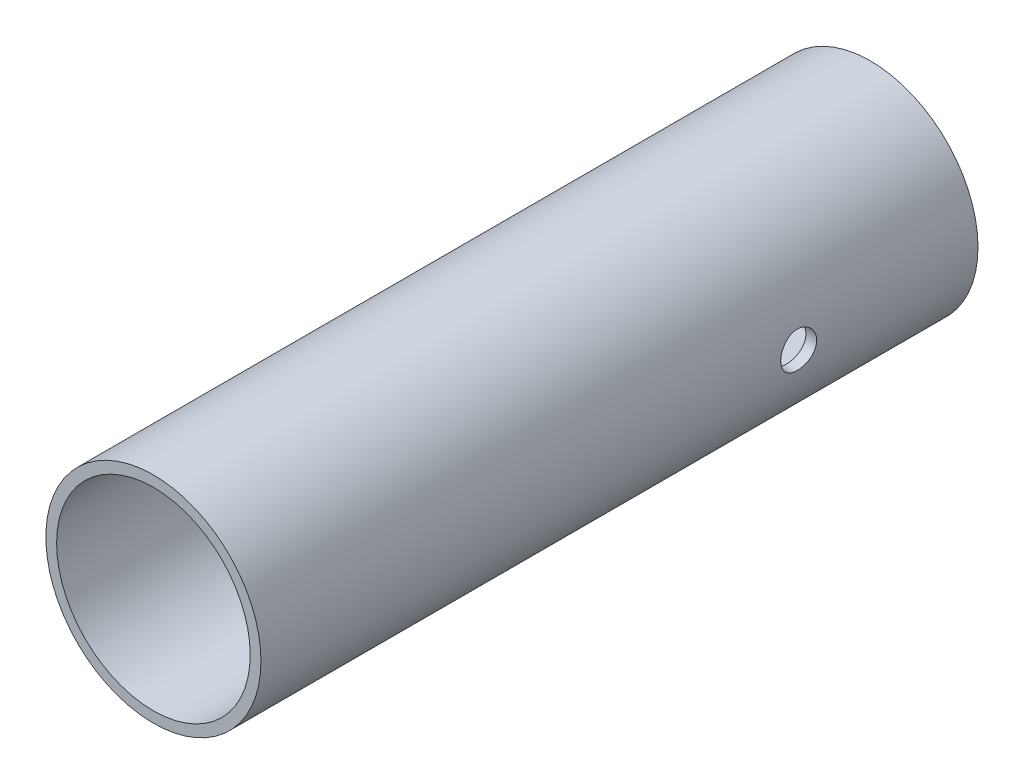
ISO-10303-21;
HEADER;
FILE_DESCRIPTION(('STEP AP214'),'2;1');
FILE_NAME('part.step','',(''),(''),'','','');
FILE_SCHEMA(('AUTOMOTIVE_DESIGN { 1 0 10303 214 1 1 1 1 }'));
ENDSEC;
DATA;
#1=APPLICATION_CONTEXT('core data for automotive mechanical design processes');
#2=APPLICATION_PROTOCOL_DEFINITION('international standard','automotive_design',2000,#1);
#3=PRODUCT_CONTEXT('',#1,'mechanical');
#4=PRODUCT('Part','Part','',(#3));
#5=PRODUCT_RELATED_PRODUCT_CATEGORY('part','',(#4));
#6=PRODUCT_DEFINITION_FORMATION('','',#4);
#7=PRODUCT_DEFINITION_CONTEXT('part definition',#1,'design');
#8=PRODUCT_DEFINITION('design','',#6,#7);
#9=PRODUCT_DEFINITION_SHAPE('','',#8);
#10=(LENGTH_UNIT() NAMED_UNIT(*) SI_UNIT(.MILLI.,.METRE.));
#11=(NAMED_UNIT(*) PLANE_ANGLE_UNIT() SI_UNIT($,.RADIAN.));
#12=(NAMED_UNIT(*) SI_UNIT($,.STERADIAN.) SOLID_ANGLE_UNIT());
#13=UNCERTAINTY_MEASURE_WITH_UNIT(LENGTH_MEASURE(1.E-05),#10,'distance_accuracy_value','');
#14=(GEOMETRIC_REPRESENTATION_CONTEXT(3) GLOBAL_UNCERTAINTY_ASSIGNED_CONTEXT((#13)) GLOBAL_UNIT_ASSIGNED_CONTEXT((#10,
#11,#12)) REPRESENTATION_CONTEXT('',''));
#15=CARTESIAN_POINT('',(0.,0.,0.));
#16=DIRECTION('',(0.,0.,1.));
#17=DIRECTION('',(1.,0.,0.));
#18=AXIS2_PLACEMENT_3D('',#15,#16,#17);
#19=CARTESIAN_POINT('',(0.,0.,200.));
#20=DIRECTION('',(0.,0.,1.));
#21=DIRECTION('',(1.,0.,0.));
#22=AXIS2_PLACEMENT_3D('',#19,#20,#21);
#23=PLANE('',#22);
#24=CARTESIAN_POINT('',(0.,0.,200.));
#25=DIRECTION('',(0.,0.,1.));
#26=DIRECTION('',(1.,0.,0.));
#27=AXIS2_PLACEMENT_3D('',#24,#25,#26);
#28=CIRCLE('',#27,30.);
#29=CARTESIAN_POINT('',(30.,0.,200.));
#30=VERTEX_POINT('',#29);
#31=EDGE_CURVE('E81',#30,#30,#28,.T.);
#32=ORIENTED_EDGE('',*,*,#31,.T.);
#33=EDGE_LOOP('',(#32));
#34=FACE_BOUND('',#33,.T.);
#35=CARTESIAN_POINT('',(0.,0.,200.));
#36=DIRECTION('',(0.,0.,1.));
#37=DIRECTION('',(1.,0.,0.));
#38=AXIS2_PLACEMENT_3D('',#35,#36,#37);
#39=CIRCLE('',#38,27.);
#40=CARTESIAN_POINT('',(27.,0.,200.));
#41=VERTEX_POINT('',#40);
#42=EDGE_CURVE('E165',#41,#41,#39,.T.);
#43=ORIENTED_EDGE('',*,*,#42,.F.);
#44=EDGE_LOOP('',(#43));
#45=FACE_BOUND('',#44,.T.);
#46=ADVANCED_FACE('F43',(#34,#45),#23,.T.);
#47=CARTESIAN_POINT('',(0.,0.,0.));
#48=DIRECTION('',(0.,0.,1.));
#49=DIRECTION('',(1.,0.,0.));
#50=AXIS2_PLACEMENT_3D('',#47,#48,#49);
#51=PLANE('',#50);
#52=CARTESIAN_POINT('',(0.,0.,0.));
#53=DIRECTION('',(0.,0.,1.));
#54=DIRECTION('',(1.,0.,0.));
#55=AXIS2_PLACEMENT_3D('',#52,#53,#54);
#56=CIRCLE('',#55,30.);
#57=CARTESIAN_POINT('',(30.,0.,0.));
#58=VERTEX_POINT('',#57);
#59=EDGE_CURVE('E168',#58,#58,#56,.T.);
#60=ORIENTED_EDGE('',*,*,#59,.F.);
#61=EDGE_LOOP('',(#60));
#62=FACE_BOUND('',#61,.T.);
#63=CARTESIAN_POINT('',(0.,0.,0.));
#64=DIRECTION('',(0.,0.,1.));
#65=DIRECTION('',(1.,0.,0.));
#66=AXIS2_PLACEMENT_3D('',#63,#64,#65);
#67=CIRCLE('',#66,27.);
#68=CARTESIAN_POINT('',(27.,0.,0.));
#69=VERTEX_POINT('',#68);
#70=EDGE_CURVE('E96',#69,#69,#67,.T.);
#71=ORIENTED_EDGE('',*,*,#70,.T.);
#72=EDGE_LOOP('',(#71));
#73=FACE_BOUND('',#72,.T.);
#74=ADVANCED_FACE('F154',(#62,#73),#51,.F.);
#75=CARTESIAN_POINT('',(0.,0.,200.));
#76=DIRECTION('',(0.,0.,-1.));
#77=DIRECTION('',(-1.,0.,0.));
#78=AXIS2_PLACEMENT_3D('',#75,#76,#77);
#79=CYLINDRICAL_SURFACE('',#78,30.);
#80=CARTESIAN_POINT('',(-30.,0.,45.));
#81=CARTESIAN_POINT('',(-30.0000009341092,0.139438730306521,44.999997851397));
#82=CARTESIAN_POINT('',(-29.9990260400444,0.278848374995364,45.0058347556485));
#83=CARTESIAN_POINT('',(-29.9951557115238,0.556708896140975,45.0291341835026));
#84=CARTESIAN_POINT('',(-29.9922598968632,0.695159577308833,45.0465990086043));
#85=CARTESIAN_POINT('',(-29.9846251699259,0.970150520344154,45.0930388128981));
#86=CARTESIAN_POINT('',(-29.979885095025,1.10668952072418,45.1220210529316));
#87=CARTESIAN_POINT('',(-29.9686930297133,1.37685247096437,45.1912860554059));
#88=CARTESIAN_POINT('',(-29.9622404112013,1.5104753317869,45.2315729643164));
#89=CARTESIAN_POINT('',(-29.9478128865368,1.77365528085701,45.323085001361));
#90=CARTESIAN_POINT('',(-29.9398398129292,1.90321704710935,45.3742969706778));
#91=CARTESIAN_POINT('',(-29.9225843720656,2.15759207174615,45.487331768374));
#92=CARTESIAN_POINT('',(-29.9133015225275,2.28240355940392,45.5491585071213));
#93=CARTESIAN_POINT('',(-29.8936901460056,2.5263122321717,45.6829311123826));
#94=CARTESIAN_POINT('',(-29.8833621400859,2.64541222152924,45.7548719433986));
#95=CARTESIAN_POINT('',(-29.8619368035706,2.87720075943644,45.9084173224229));
#96=CARTESIAN_POINT('',(-29.8508391875783,2.98988690101177,45.9900254634165));
#97=CARTESIAN_POINT('',(-29.8280901061561,3.20893550320273,46.1630259516604));
#98=CARTESIAN_POINT('',(-29.8164348485225,3.31523860199369,46.2544929703539));
#99=CARTESIAN_POINT('',(-29.792977049997,3.51981905081323,46.4460558937281));
#100=CARTESIAN_POINT('',(-29.7811744561748,3.61809341494839,46.5461549804905));
#101=CARTESIAN_POINT('',(-29.757760553176,3.80586900468399,46.7542344342712));
#102=CARTESIAN_POINT('',(-29.7461491869625,3.89537288715649,46.862212397114));
#103=CARTESIAN_POINT('',(-29.7234367117224,4.06505128766862,47.0853792425903));
#104=CARTESIAN_POINT('',(-29.7123357924676,4.14522235269034,47.2005707700571));
#105=CARTESIAN_POINT('',(-29.6909016370194,4.29606801839331,47.4380285253062));
#106=CARTESIAN_POINT('',(-29.6805732300208,4.36668480543057,47.5603319317773));
#107=CARTESIAN_POINT('',(-29.6610510502017,4.49737903615682,47.8105890866492));
#108=CARTESIAN_POINT('',(-29.6518577016161,4.55745254274492,47.9385449235652));
#109=CARTESIAN_POINT('',(-29.6348831234285,4.66655756396112,48.199119311015));
#110=CARTESIAN_POINT('',(-29.6271012976113,4.71559374278069,48.3317358645124));
#111=CARTESIAN_POINT('',(-29.6131700678879,4.80229722760727,48.600732309735));
#112=CARTESIAN_POINT('',(-29.6070212600786,4.83996038282923,48.7371135556791));
#113=CARTESIAN_POINT('',(-29.5914227981395,4.93477467758657,49.1478014758557));
#114=CARTESIAN_POINT('',(-29.5846386003063,4.97488357358492,49.4263688653698));
#115=CARTESIAN_POINT('',(-29.5790755483693,5.00784793424047,49.9862031583844));
#116=CARTESIAN_POINT('',(-29.5802961277241,5.00070674304214,50.2674698694324));
#117=CARTESIAN_POINT('',(-29.590529429811,4.93978637434361,50.8218444785728));
#118=CARTESIAN_POINT('',(-29.5994616948564,4.88648873937524,51.0950065937395));
#119=CARTESIAN_POINT('',(-29.6239896757343,4.73550730524631,51.6284456491125));
#120=CARTESIAN_POINT('',(-29.6395856201047,4.63782198375657,51.8887221470515));
#121=CARTESIAN_POINT('',(-29.6757696483376,4.40035421574882,52.3904568337189));
#122=CARTESIAN_POINT('',(-29.6963813586744,4.2603717536546,52.6318185941789));
#123=CARTESIAN_POINT('',(-29.7402583517709,3.94242410922567,53.0878090190779));
#124=CARTESIAN_POINT('',(-29.7635238486315,3.76445586128013,53.3024355236554));
#125=CARTESIAN_POINT('',(-29.8104405621052,3.37296440409905,53.7016521121411));
#126=CARTESIAN_POINT('',(-29.8340929858412,3.15902792232791,53.8858370211496));
#127=CARTESIAN_POINT('',(-29.8788520267263,2.70307050338167,54.2157555412613));
#128=CARTESIAN_POINT('',(-29.8999586274719,2.46104938526711,54.361488904615));
#129=CARTESIAN_POINT('',(-29.9372778581815,1.95541183087794,54.6104044500204));
#130=CARTESIAN_POINT('',(-29.9534863682324,1.6917774507324,54.7135508376042));
#131=CARTESIAN_POINT('',(-29.9791500601698,1.15059669160235,54.8739884315502));
#132=CARTESIAN_POINT('',(-29.988605806999,0.873051478491177,54.9312834739288));
#133=CARTESIAN_POINT('',(-29.999622596864,0.315419802472569,54.9978427169407));
#134=CARTESIAN_POINT('',(-30.0012750602153,0.0354014741699832,55.0076631447181));
#135=CARTESIAN_POINT('',(-29.9967494884638,-0.522279545647728,54.9804773100369));
#136=CARTESIAN_POINT('',(-29.9905717546544,-0.799942327386594,54.9434728493235));
#137=CARTESIAN_POINT('',(-29.971136538593,-1.34331235148859,54.8241503057114));
#138=CARTESIAN_POINT('',(-29.9579220953842,-1.60908173821581,54.7421075996025));
#139=CARTESIAN_POINT('',(-29.9258892897492,-2.12309376827573,54.5353309472172));
#140=CARTESIAN_POINT('',(-29.9070706126377,-2.3713354264338,54.4105946035757));
#141=CARTESIAN_POINT('',(-29.8656903236297,-2.84566138437112,54.1206978123005));
#142=CARTESIAN_POINT('',(-29.8430971086773,-3.07153052223236,53.9551899188577));
#143=CARTESIAN_POINT('',(-29.7967693569018,-3.4924871506458,53.5889251380208));
#144=CARTESIAN_POINT('',(-29.7730347372687,-3.68757240338596,53.3881656902801));
#145=CARTESIAN_POINT('',(-29.7268034705286,-4.04348563611054,52.9546057759653));
#146=CARTESIAN_POINT('',(-29.7043221945332,-4.20393781021311,52.7214949394481));
#147=CARTESIAN_POINT('',(-29.6634307237625,-4.48340433261339,52.2312907913497));
#148=CARTESIAN_POINT('',(-29.6450203999454,-4.60241999444131,51.9741982403122));
#149=CARTESIAN_POINT('',(-29.6144685973239,-4.79507773356376,51.4444326927225));
#150=CARTESIAN_POINT('',(-29.602301310812,-4.8689068530604,51.1718290988087));
#151=CARTESIAN_POINT('',(-29.5855561119601,-4.96966691993876,50.6177144566247));
#152=CARTESIAN_POINT('',(-29.580977539818,-4.99660194454597,50.3362041849162));
#153=CARTESIAN_POINT('',(-29.5801885462874,-5.00123212445088,49.9155902165825));
#154=CARTESIAN_POINT('',(-29.5809172344068,-4.99693975789016,49.7764630779757));
#155=CARTESIAN_POINT('',(-29.5843160283654,-4.9767843680174,49.4990874155143));
#156=CARTESIAN_POINT('',(-29.5869854047428,-4.96092569221813,49.3608385812147));
#157=CARTESIAN_POINT('',(-29.5941926651669,-4.9177464052992,49.0861522107232));
#158=CARTESIAN_POINT('',(-29.5987312164982,-4.89042170080801,48.9497153393651));
#159=CARTESIAN_POINT('',(-29.6095423170401,-4.82453301754956,48.6797035451246));
#160=CARTESIAN_POINT('',(-29.615814242021,-4.78597308458849,48.5461276105738));
#161=CARTESIAN_POINT('',(-29.6299071307843,-4.69793428640029,48.2828313948784));
#162=CARTESIAN_POINT('',(-29.6377268263817,-4.64846435664849,48.153108056479));
#163=CARTESIAN_POINT('',(-29.6546930297384,-4.5389698667498,47.8983412735622));
#164=CARTESIAN_POINT('',(-29.6638390620139,-4.47894908739057,47.773296172049));
#165=CARTESIAN_POINT('',(-29.6832065043881,-4.34874498523011,47.5286385492005));
#166=CARTESIAN_POINT('',(-29.6934283356131,-4.27855767862002,47.4090281817446));
#167=CARTESIAN_POINT('',(-29.7146554589665,-4.12855715704192,47.1761384743683));
#168=CARTESIAN_POINT('',(-29.7256604751555,-4.04874732556527,47.0628569294789));
#169=CARTESIAN_POINT('',(-29.7482907408856,-3.87899685367997,46.8419913012979));
#170=CARTESIAN_POINT('',(-29.7599219326499,-3.78894418512201,46.7344939098959));
#171=CARTESIAN_POINT('',(-29.783347263822,-3.60017574898996,46.527486603521));
#172=CARTESIAN_POINT('',(-29.7951413435574,-3.50146308651916,46.4279738499038));
#173=CARTESIAN_POINT('',(-29.8185735949796,-3.29596225179814,46.2375180700226));
#174=CARTESIAN_POINT('',(-29.8302116694714,-3.18916929766622,46.1465801909689));
#175=CARTESIAN_POINT('',(-29.8529952569281,-2.96833108680549,45.9740042838951));
#176=CARTESIAN_POINT('',(-29.8641409501131,-2.8542885214692,45.8923628356654));
#177=CARTESIAN_POINT('',(-29.8857116363867,-2.61883824287209,45.7383549695894));
#178=CARTESIAN_POINT('',(-29.896130775176,-2.49738284629916,45.6660606010677));
#179=CARTESIAN_POINT('',(-29.9158586577262,-2.24876507402074,45.5320032528141));
#180=CARTESIAN_POINT('',(-29.925167809621,-2.1216048197654,45.4702363985834));
#181=CARTESIAN_POINT('',(-29.9424090895346,-1.86251821435404,45.3576992937319));
#182=CARTESIAN_POINT('',(-29.950342172599,-1.73059524615479,45.3069214102253));
#183=CARTESIAN_POINT('',(-29.9646113279921,-1.46288984328884,45.2167051811047));
#184=CARTESIAN_POINT('',(-29.9709477429356,-1.32710824358209,45.1772644025061));
#185=CARTESIAN_POINT('',(-29.9841083147641,-0.995492141379855,45.0960216988299));
#186=CARTESIAN_POINT('',(-29.9900398634941,-0.798161887183508,45.0600563429683));
#187=CARTESIAN_POINT('',(-29.9979850016837,-0.400534394814455,45.0120472422013));
#188=CARTESIAN_POINT('',(-29.9999986585978,-0.200237207783447,45.0000030854431));
#189=CARTESIAN_POINT('',(-30.,0.,45.));
#190=B_SPLINE_CURVE_WITH_KNOTS('',3,(#80,#81,#82,#83,#84,#85,#86,#87,#88,#89,#90,#91,#92,#93,
#94,#95,#96,#97,#98,#99,#100,#101,#102,#103,#104,#105,#106,#107,#108,#109,#110,#111,#112,#113,
#114,#115,#116,#117,#118,#119,#120,#121,#122,#123,#124,#125,#126,#127,#128,#129,#130,#131,#132,
#133,#134,#135,#136,#137,#138,#139,#140,#141,#142,#143,#144,#145,#146,#147,#148,#149,#150,#151,
#152,#153,#154,#155,#156,#157,#158,#159,#160,#161,#162,#163,#164,#165,#166,#167,#168,#169,#170,
#171,#172,#173,#174,#175,#176,#177,#178,#179,#180,#181,#182,#183,#184,#185,#186,#187,#188,#189),
.UNSPECIFIED.,.T.,.F.,(4,2,2,2,2,2,2,2,2,2,2,2,2,2,2,2,2,2,2,2,2,2,2,2,2,2,2,2,2,2,2,2,2,2,2,2,
2,2,2,2,2,2,2,2,2,2,2,2,2,2,2,2,2,2,4),(0.,0.418140677636318,0.836364141924729,1.25485168316257,
1.67349292366114,2.09163274536573,2.5099269371459,2.92801360569261,3.34625615217359,
3.76792473637698,4.18974943231195,4.61144594582071,5.03329798883919,5.45759827861685,
5.88205667621391,6.30633536657098,6.73076871826471,7.57090272280956,8.41097726715882,
9.24239161594926,10.0738344812487,10.9092723133922,11.7447775943525,12.5906365789676,
13.436501013458,14.2830749590591,15.129578071164,15.966138850569,16.8026674414583,
17.6341373208694,18.4656538972624,19.3045176932815,20.1434424418267,20.9910576208934,
21.8386459282599,22.6827016275765,23.5266839364734,23.943862966713,24.3608852695981,
24.7780565762499,25.1950778447661,25.6117588257788,26.0282907967258,26.4449864317717,
26.861535972448,27.2831832626946,27.7046799813851,28.1264281209231,28.5480205921466,
28.9726903230861,29.3972034214197,29.8214207018256,30.245546875553,30.846016796232,
31.446476378491),.UNSPECIFIED.);
#191=CARTESIAN_POINT('',(-30.,0.,45.));
#192=VERTEX_POINT('',#191);
#193=EDGE_CURVE('E91',#192,#192,#190,.T.);
#194=ORIENTED_EDGE('',*,*,#193,.T.);
#195=EDGE_LOOP('',(#194));
#196=FACE_BOUND('',#195,.T.);
#197=CARTESIAN_POINT('',(29.975,-1.2244896896258,45.1522556791844));
#198=CARTESIAN_POINT('',(29.9694375962078,-1.36085341032094,45.1866839138636));
#199=CARTESIAN_POINT('',(29.962988413425,-1.49571661718018,45.2268845373549));
#200=CARTESIAN_POINT('',(29.9485345498424,-1.76149327115684,45.3184560952568));
#201=CARTESIAN_POINT('',(29.9405300516752,-1.89240717993679,45.3698257182337));
#202=CARTESIAN_POINT('',(29.9231910078997,-2.14923862859925,45.4833114777652));
#203=CARTESIAN_POINT('',(29.9138578196197,-2.27516110170596,45.5454166610706));
#204=CARTESIAN_POINT('',(29.8941197603895,-2.52127692984023,45.6799504571785));
#205=CARTESIAN_POINT('',(29.8837148819627,-2.64147024489,45.7523791420038));
#206=CARTESIAN_POINT('',(29.8621243999678,-2.87529406921399,45.9070386539423));
#207=CARTESIAN_POINT('',(29.85093882507,-2.9889248192122,45.989269121173));
#208=CARTESIAN_POINT('',(29.8280949365349,-3.2088916741323,46.1629878454813));
#209=CARTESIAN_POINT('',(29.8164364497285,-3.31522506786423,46.2544795124649));
#210=CARTESIAN_POINT('',(29.7929812633112,-3.51978187519843,46.446021868347));
#211=CARTESIAN_POINT('',(29.7811846224197,-3.61800860104324,46.5460690272585));
#212=CARTESIAN_POINT('',(29.7577744125255,-3.80576113133981,46.7541068733148));
#213=CARTESIAN_POINT('',(29.7461609128781,-3.89528370283087,46.8621004860234));
#214=CARTESIAN_POINT('',(29.7233817553101,-4.06546344309396,47.0859159092934));
#215=CARTESIAN_POINT('',(29.7122191248981,-4.14606551253463,47.2017799335435));
#216=CARTESIAN_POINT('',(29.6907307304263,-4.29724832092564,47.4400066037102));
#217=CARTESIAN_POINT('',(29.6804052790844,-4.36782532246918,47.5623716500103));
#218=CARTESIAN_POINT('',(29.6608976837227,-4.49838935395414,47.8126702622326));
#219=CARTESIAN_POINT('',(29.6517152126806,-4.55837941502449,47.9406022211824));
#220=CARTESIAN_POINT('',(29.6347553799039,-4.66736742082048,48.2012122825937));
#221=CARTESIAN_POINT('',(29.6269785323911,-4.71636134438592,48.3338921007946));
#222=CARTESIAN_POINT('',(29.6131072783644,-4.80268446849643,48.6021614906415));
#223=CARTESIAN_POINT('',(29.6070026533979,-4.84008470839615,48.7377276734071));
#224=CARTESIAN_POINT('',(29.5965894740168,-4.90335817462528,49.0116455721217));
#225=CARTESIAN_POINT('',(29.5922815841599,-4.92922713612816,49.14999829893));
#226=CARTESIAN_POINT('',(29.5855947209451,-4.96920486173593,49.428367433794));
#227=CARTESIAN_POINT('',(29.5832147634147,-4.98331962623713,49.5683829559371));
#228=CARTESIAN_POINT('',(29.5804500911259,-4.99970401302449,49.8491747526105));
#229=CARTESIAN_POINT('',(29.5800661075169,-5.00196929470382,49.9899512870087));
#230=CARTESIAN_POINT('',(29.5813003304671,-4.99466619127279,50.2694370273893));
#231=CARTESIAN_POINT('',(29.5828935969935,-4.9852452114153,50.4081500985457));
#232=CARTESIAN_POINT('',(29.5879896874776,-4.9549042501804,50.6842915272929));
#233=CARTESIAN_POINT('',(29.5914932093136,-4.93398006628514,50.8217193966828));
#234=CARTESIAN_POINT('',(29.6047355815401,-4.8541464378944,51.2305094827098));
#235=CARTESIAN_POINT('',(29.6172077854026,-4.77816818769822,51.4986626825074));
#236=CARTESIAN_POINT('',(29.6480408332987,-4.58293783602689,52.0183949264651));
#237=CARTESIAN_POINT('',(29.6664058102725,-4.46365535506844,52.2699621882313));
#238=CARTESIAN_POINT('',(29.7069612087054,-4.18523410136701,52.7496703848356));
#239=CARTESIAN_POINT('',(29.7291517241531,-4.02609434933773,52.9778107438845));
#240=CARTESIAN_POINT('',(29.7752030870657,-3.67012298626588,53.407191300291));
#241=CARTESIAN_POINT('',(29.7990813512309,-3.47284494695979,53.6080594578701));
#242=CARTESIAN_POINT('',(29.8455906744257,-3.04736202662762,53.9739522161299));
#243=CARTESIAN_POINT('',(29.8682219010042,-2.81916131461418,54.1389816408168));
#244=CARTESIAN_POINT('',(29.907095467426,-2.36855341807816,54.4102221097549));
#245=CARTESIAN_POINT('',(29.9237839570908,-2.14907344631766,54.5212355805833));
#246=CARTESIAN_POINT('',(29.9455999340874,-1.80941372085991,54.6627361561107));
#247=CARTESIAN_POINT('',(29.9523371983646,-1.69442106692063,54.7057413887027));
#248=CARTESIAN_POINT('',(29.9646062428044,-1.46150806406141,54.7832054084369));
#249=CARTESIAN_POINT('',(29.9701378177027,-1.34358722042837,54.8176627404677));
#250=CARTESIAN_POINT('',(29.975,-1.22448968962579,54.8477443208156));
#251=B_SPLINE_CURVE_WITH_KNOTS('',3,(#197,#198,#199,#200,#201,#202,#203,#204,#205,#206,#207,
#208,#209,#210,#211,#212,#213,#214,#215,#216,#217,#218,#219,#220,#221,#222,#223,#224,#225,#226,
#227,#228,#229,#230,#231,#232,#233,#234,#235,#236,#237,#238,#239,#240,#241,#242,#243,#244,#245,
#246,#247,#248,#249,#250),.UNSPECIFIED.,.F.,.F.,(4,2,2,2,2,2,2,2,2,2,2,2,2,2,2,2,2,2,2,2,2,2,2,
2,2,2,4),(0.,0.42212072957739,0.844191921625176,1.26583499865214,1.6874810174546,
2.10911155986046,2.53089791215558,2.95251106784483,3.37428022869377,3.79852410042349,
4.2229257200831,4.6472056322066,5.07164044669495,5.4934206748605,5.91535676866165,
6.33707733617169,6.7589523741414,7.17555976406753,7.59231945630744,8.42499578416147,
9.25825739695962,10.0915394848611,10.9352411979807,11.7788292757096,12.515567632751,
12.8841378882871,13.25277084265),.UNSPECIFIED.);
#252=CARTESIAN_POINT('',(29.975,-1.22448968962579,45.1522556791844));
#253=VERTEX_POINT('',#252);
#254=CARTESIAN_POINT('',(29.975,-1.2244896896258,54.8477443208156));
#255=VERTEX_POINT('',#254);
#256=EDGE_CURVE('E85',#253,#255,#251,.T.);
#257=ORIENTED_EDGE('',*,*,#256,.T.);
#258=CARTESIAN_POINT('',(29.9723,-1.28888816815102,54.828226856725));
#259=CARTESIAN_POINT('',(29.9774792161518,-1.16862735748478,54.8657051438384));
#260=CARTESIAN_POINT('',(29.9819893969917,-1.04671081938261,54.8979833554159));
#261=CARTESIAN_POINT('',(29.9895698792429,-0.8004702567467,54.9518680335267));
#262=CARTESIAN_POINT('',(29.9926398563378,-0.676145696512674,54.9734720964298));
#263=CARTESIAN_POINT('',(29.9971761623874,-0.429287873625843,55.0053020155114));
#264=CARTESIAN_POINT('',(29.9986819788812,-0.306791654512645,55.0158081632507));
#265=CARTESIAN_POINT('',(30.0001882899959,-0.0614018397805707,55.0263144821186));
#266=CARTESIAN_POINT('',(30.0001892394808,0.061491624535011,55.0263178278434));
#267=CARTESIAN_POINT('',(29.9982940489119,0.36961910153008,55.0131073537412));
#268=CARTESIAN_POINT('',(29.9954282590263,0.554619431812374,54.9931387642707));
#269=CARTESIAN_POINT('',(29.9886430596383,0.830693982127712,54.9452556232475));
#270=CARTESIAN_POINT('',(29.985926565339,0.923405855127198,54.9260188309716));
#271=CARTESIAN_POINT('',(29.979697546751,1.10733904490896,54.8815701444404));
#272=CARTESIAN_POINT('',(29.9761851887493,1.1985606688003,54.8563594983074));
#273=CARTESIAN_POINT('',(29.9723,1.28888816815103,54.828226856725));
#274=B_SPLINE_CURVE_WITH_KNOTS('',3,(#258,#259,#260,#261,#262,#263,#264,#265,#266,#267,#268,
#269,#270,#271,#272,#273),.UNSPECIFIED.,.F.,.F.,(4,2,2,2,2,2,2,4),(0.,0.378105811686945,
0.756296727376384,1.12468924586133,1.49297041333425,2.04944115162784,2.33344798419236,
2.6173955312067),.UNSPECIFIED.);
#275=CARTESIAN_POINT('',(29.975,1.2244896896258,54.8477443208156));
#276=VERTEX_POINT('',#275);
#277=EDGE_CURVE('E11',#255,#276,#274,.T.);
#278=ORIENTED_EDGE('',*,*,#277,.T.);
#279=CARTESIAN_POINT('',(29.975,1.2244896896258,54.8477443208156));
#280=CARTESIAN_POINT('',(29.9694375962078,1.36085341032094,54.8133160861364));
#281=CARTESIAN_POINT('',(29.962988413425,1.49571661718018,54.7731154626451));
#282=CARTESIAN_POINT('',(29.9485345498424,1.76149327115684,54.6815439047432));
#283=CARTESIAN_POINT('',(29.9405300516752,1.89240717993679,54.6301742817663));
#284=CARTESIAN_POINT('',(29.9231910078997,2.14923862859926,54.5166885222348));
#285=CARTESIAN_POINT('',(29.9138578196197,2.27516110170596,54.4545833389294));
#286=CARTESIAN_POINT('',(29.8941197603895,2.52127692984024,54.3200495428215));
#287=CARTESIAN_POINT('',(29.8837148819627,2.64147024489,54.2476208579962));
#288=CARTESIAN_POINT('',(29.8621243999678,2.875294069214,54.0929613460577));
#289=CARTESIAN_POINT('',(29.85093882507,2.98892481921221,54.010730878827));
#290=CARTESIAN_POINT('',(29.8280949365349,3.20889167413231,53.8370121545187));
#291=CARTESIAN_POINT('',(29.8164364497285,3.31522506786423,53.7455204875351));
#292=CARTESIAN_POINT('',(29.7929812633112,3.51978187519844,53.553978131653));
#293=CARTESIAN_POINT('',(29.7811846224197,3.61800860104324,53.4539309727415));
#294=CARTESIAN_POINT('',(29.7577744125255,3.80576113133982,53.2458931266852));
#295=CARTESIAN_POINT('',(29.7461609128781,3.89528370283087,53.1378995139766));
#296=CARTESIAN_POINT('',(29.7233817553101,4.06546344309396,52.9140840907066));
#297=CARTESIAN_POINT('',(29.7122191248981,4.14606551253463,52.7982200664565));
#298=CARTESIAN_POINT('',(29.6907307304263,4.29724832092564,52.5599933962898));
#299=CARTESIAN_POINT('',(29.6804052790844,4.36782532246919,52.4376283499897));
#300=CARTESIAN_POINT('',(29.6608976837227,4.49838935395415,52.1873297377674));
#301=CARTESIAN_POINT('',(29.6517152126806,4.55837941502449,52.0593977788176));
#302=CARTESIAN_POINT('',(29.6347553799039,4.66736742082048,51.7987877174063));
#303=CARTESIAN_POINT('',(29.6269785323911,4.71636134438592,51.6661078992054));
#304=CARTESIAN_POINT('',(29.6131072783644,4.80268446849643,51.3978385093585));
#305=CARTESIAN_POINT('',(29.6070026533979,4.84008470839615,51.2622723265929));
#306=CARTESIAN_POINT('',(29.5965894740168,4.90335817462529,50.9883544278783));
#307=CARTESIAN_POINT('',(29.5922815841599,4.92922713612817,50.85000170107));
#308=CARTESIAN_POINT('',(29.5855947209451,4.96920486173594,50.571632566206));
#309=CARTESIAN_POINT('',(29.5832147634147,4.98331962623713,50.431617044063));
#310=CARTESIAN_POINT('',(29.5804500911259,4.9997040130245,50.1508252473896));
#311=CARTESIAN_POINT('',(29.5800661075169,5.00196929470383,50.0100487129913));
#312=CARTESIAN_POINT('',(29.5813003304671,4.9946661912728,49.7305629726107));
#313=CARTESIAN_POINT('',(29.5828935969935,4.98524521141531,49.5918499014543));
#314=CARTESIAN_POINT('',(29.5879896874776,4.95490425018041,49.3157084727071));
#315=CARTESIAN_POINT('',(29.5914932093136,4.93398006628515,49.1782806033172));
#316=CARTESIAN_POINT('',(29.6047355815401,4.85414643789441,48.7694905172902));
#317=CARTESIAN_POINT('',(29.6172077854026,4.77816818769823,48.5013373174926));
#318=CARTESIAN_POINT('',(29.6480408332987,4.58293783602689,47.9816050735349));
#319=CARTESIAN_POINT('',(29.6664058102725,4.46365535506844,47.7300378117687));
#320=CARTESIAN_POINT('',(29.7069612087054,4.18523410136701,47.2503296151644));
#321=CARTESIAN_POINT('',(29.7291517241531,4.02609434933773,47.0221892561155));
#322=CARTESIAN_POINT('',(29.7752030870657,3.67012298626588,46.592808699709));
#323=CARTESIAN_POINT('',(29.7990813512309,3.4728449469598,46.39194054213));
#324=CARTESIAN_POINT('',(29.8455906744257,3.04736202662762,46.0260477838701));
#325=CARTESIAN_POINT('',(29.8682219010042,2.81916131461419,45.8610183591832));
#326=CARTESIAN_POINT('',(29.907095467426,2.36855341807817,45.5897778902451));
#327=CARTESIAN_POINT('',(29.9237839570908,2.14907344631768,45.4787644194167));
#328=CARTESIAN_POINT('',(29.9455999340874,1.80941372085992,45.3372638438893));
#329=CARTESIAN_POINT('',(29.9523371983646,1.69442106692064,45.2942586112973));
#330=CARTESIAN_POINT('',(29.9646062428044,1.46150806406142,45.2167945915631));
#331=CARTESIAN_POINT('',(29.9701378177027,1.34358722042837,45.1823372595323));
#332=CARTESIAN_POINT('',(29.975,1.2244896896258,45.1522556791844));
#333=B_SPLINE_CURVE_WITH_KNOTS('',3,(#279,#280,#281,#282,#283,#284,#285,#286,#287,#288,#289,
#290,#291,#292,#293,#294,#295,#296,#297,#298,#299,#300,#301,#302,#303,#304,#305,#306,#307,#308,
#309,#310,#311,#312,#313,#314,#315,#316,#317,#318,#319,#320,#321,#322,#323,#324,#325,#326,#327,
#328,#329,#330,#331,#332),.UNSPECIFIED.,.F.,.F.,(4,2,2,2,2,2,2,2,2,2,2,2,2,2,2,2,2,2,2,2,2,2,2,
2,2,2,4),(0.,0.422120729577389,0.844191921625179,1.26583499865215,1.6874810174546,
2.10911155986047,2.53089791215558,2.95251106784483,3.37428022869377,3.7985241004235,
4.22292572008309,4.6472056322066,5.07164044669495,5.49342067486051,5.91535676866165,
6.33707733617168,6.75895237414139,7.17555976406753,7.59231945630745,8.42499578416148,
9.25825739695963,10.0915394848611,10.9352411979807,11.7788292757096,12.515567632751,
12.8841378882871,13.25277084265),.UNSPECIFIED.);
#334=CARTESIAN_POINT('',(29.975,1.2244896896258,45.1522556791844));
#335=VERTEX_POINT('',#334);
#336=EDGE_CURVE('E84',#276,#335,#333,.T.);
#337=ORIENTED_EDGE('',*,*,#336,.T.);
#338=CARTESIAN_POINT('',(29.9723,1.28888816815103,45.171773143275));
#339=CARTESIAN_POINT('',(29.9774792161518,1.16862735748479,45.1342948561616));
#340=CARTESIAN_POINT('',(29.9819893969917,1.04671081938262,45.1020166445841));
#341=CARTESIAN_POINT('',(29.9895698792429,0.800470256746709,45.0481319664733));
#342=CARTESIAN_POINT('',(29.9926398563378,0.676145696512683,45.0265279035702));
#343=CARTESIAN_POINT('',(29.9971761623874,0.429287873625853,44.9946979844886));
#344=CARTESIAN_POINT('',(29.9986819788812,0.306791654512655,44.9841918367493));
#345=CARTESIAN_POINT('',(30.0001882899959,0.0614018397805801,44.9736855178814));
#346=CARTESIAN_POINT('',(30.0001892394808,-0.0614916245350017,44.9736821721566));
#347=CARTESIAN_POINT('',(29.9982940489119,-0.369619101530071,44.9868926462588));
#348=CARTESIAN_POINT('',(29.9954282590263,-0.554619431812366,45.0068612357293));
#349=CARTESIAN_POINT('',(29.9886430596383,-0.830693982127703,45.0547443767525));
#350=CARTESIAN_POINT('',(29.985926565339,-0.92340585512719,45.0739811690284));
#351=CARTESIAN_POINT('',(29.979697546751,-1.10733904490895,45.1184298555596));
#352=CARTESIAN_POINT('',(29.9761851887493,-1.19856066880029,45.1436405016926));
#353=CARTESIAN_POINT('',(29.9723,-1.28888816815102,45.171773143275));
#354=B_SPLINE_CURVE_WITH_KNOTS('',3,(#338,#339,#340,#341,#342,#343,#344,#345,#346,#347,#348,
#349,#350,#351,#352,#353),.UNSPECIFIED.,.F.,.F.,(4,2,2,2,2,2,2,4),(0.,0.378105811686945,
0.756296727376385,1.12468924586133,1.49297041333425,2.04944115162784,2.33344798419236,
2.6173955312067),.UNSPECIFIED.);
#355=EDGE_CURVE('E58',#335,#253,#354,.T.);
#356=ORIENTED_EDGE('',*,*,#355,.T.);
#357=EDGE_LOOP('',(#257,#278,#337,#356));
#358=FACE_BOUND('',#357,.T.);
#359=ORIENTED_EDGE('',*,*,#31,.F.);
#360=EDGE_LOOP('',(#359));
#361=FACE_BOUND('',#360,.T.);
#362=ORIENTED_EDGE('',*,*,#59,.T.);
#363=EDGE_LOOP('',(#362));
#364=FACE_BOUND('',#363,.T.);
#365=ADVANCED_FACE('F45',(#196,#358,#361,#364),#79,.T.);
#366=CARTESIAN_POINT('',(0.,0.,200.));
#367=DIRECTION('',(0.,0.,-1.));
#368=DIRECTION('',(-1.,0.,0.));
#369=AXIS2_PLACEMENT_3D('',#366,#367,#368);
#370=CYLINDRICAL_SURFACE('',#369,27.);
#371=CARTESIAN_POINT('',(-27.,0.,55.));
#372=CARTESIAN_POINT('',(-27.0000011760326,-0.139198402917015,55.0000024699379));
#373=CARTESIAN_POINT('',(-26.998921618947,-0.278364741431728,54.9941854977806));
#374=CARTESIAN_POINT('',(-26.9946360919045,-0.555737001810643,54.9709675004771));
#375=CARTESIAN_POINT('',(-26.9914297339944,-0.693942743802335,54.9535643618775));
#376=CARTESIAN_POINT('',(-26.9829762754062,-0.968433858074517,54.9072928039426));
#377=CARTESIAN_POINT('',(-26.9777280116532,-1.10471808993002,54.8784178500327));
#378=CARTESIAN_POINT('',(-26.9653355643094,-1.37437288093465,54.8094151357267));
#379=CARTESIAN_POINT('',(-26.9581906844812,-1.50774235059126,54.7692832426621));
#380=CARTESIAN_POINT('',(-26.9422147776107,-1.77041125219824,54.6781348695009));
#381=CARTESIAN_POINT('',(-26.9333859132381,-1.89971565930157,54.6271323403382));
#382=CARTESIAN_POINT('',(-26.9142762389755,-2.15358925706926,54.5145698675467));
#383=CARTESIAN_POINT('',(-26.9039948940782,-2.278156681357,54.4530060319632));
#384=CARTESIAN_POINT('',(-26.882270136108,-2.5216031153913,54.3198102716848));
#385=CARTESIAN_POINT('',(-26.8708272708381,-2.64048476813229,54.2481830870598));
#386=CARTESIAN_POINT('',(-26.8470836448711,-2.87186925318301,54.0953145695971));
#387=CARTESIAN_POINT('',(-26.8347825652134,-2.98436968540745,54.0140696543718));
#388=CARTESIAN_POINT('',(-26.8095346280705,-3.20329822260329,53.8416777842821));
#389=CARTESIAN_POINT('',(-26.7965824992416,-3.30965344061783,53.7504390271541));
#390=CARTESIAN_POINT('',(-26.7705046387995,-3.51436118055656,53.5593369237819));
#391=CARTESIAN_POINT('',(-26.7573788446592,-3.61271072361219,53.4594703954246));
#392=CARTESIAN_POINT('',(-26.7313288283512,-3.80066580254503,53.2518520140035));
#393=CARTESIAN_POINT('',(-26.7184045476821,-3.89027391740952,53.1441025031771));
#394=CARTESIAN_POINT('',(-26.6931118949527,-4.06019218856548,52.9213808823963));
#395=CARTESIAN_POINT('',(-26.6807437296764,-4.14049890346407,52.806406123313));
#396=CARTESIAN_POINT('',(-26.6568312938301,-4.29176597473288,52.5691785019454));
#397=CARTESIAN_POINT('',(-26.6452937555931,-4.36265320753198,52.4468783093466));
#398=CARTESIAN_POINT('',(-26.6234750384761,-4.49388512111764,52.1965825592915));
#399=CARTESIAN_POINT('',(-26.6131943304199,-4.55422585467413,52.0685848918374));
#400=CARTESIAN_POINT('',(-26.5942017209862,-4.66385450609766,51.8078818598037));
#401=CARTESIAN_POINT('',(-26.5854891366774,-4.71314723777012,51.6751785748495));
#402=CARTESIAN_POINT('',(-26.5698816277064,-4.80034627845551,51.4059642558315));
#403=CARTESIAN_POINT('',(-26.5629873645764,-4.83824844410835,51.2694518558734));
#404=CARTESIAN_POINT('',(-26.5455068588294,-4.93360282440062,50.85889044707));
#405=CARTESIAN_POINT('',(-26.5378770786056,-4.97407286177453,50.5805454751035));
#406=CARTESIAN_POINT('',(-26.531529781667,-5.00781350821561,50.0210727410099));
#407=CARTESIAN_POINT('',(-26.5328114855687,-5.00108824490364,49.7399452243869));
#408=CARTESIAN_POINT('',(-26.5440430060161,-4.94112067014497,49.1865112218683));
#409=CARTESIAN_POINT('',(-26.5538813635239,-4.88847647356785,48.9141378315625));
#410=CARTESIAN_POINT('',(-26.5809467878036,-4.7390900652929,48.3821679286725));
#411=CARTESIAN_POINT('',(-26.5981741615496,-4.64234602147121,48.122571947421));
#412=CARTESIAN_POINT('',(-26.6381924444912,-4.4069230224231,47.6217574367947));
#413=CARTESIAN_POINT('',(-26.6610153586482,-4.2680016947149,47.3806554906389));
#414=CARTESIAN_POINT('',(-26.7096321661023,-3.95233788575466,46.9249598028895));
#415=CARTESIAN_POINT('',(-26.7354263536418,-3.77559165724599,46.7103686910096));
#416=CARTESIAN_POINT('',(-26.7875656015517,-3.3860658609167,46.3103276604886));
#417=CARTESIAN_POINT('',(-26.8139130365231,-3.17277436954696,46.1253761554364));
#418=CARTESIAN_POINT('',(-26.8638256425554,-2.71792765346525,45.7938052179575));
#419=CARTESIAN_POINT('',(-26.8873907870028,-2.47637215844225,45.6471861521775));
#420=CARTESIAN_POINT('',(-26.9291294720956,-1.97134041142273,45.3963718655069));
#421=CARTESIAN_POINT('',(-26.9472965335321,-1.70783829891925,45.2922275708276));
#422=CARTESIAN_POINT('',(-26.9761418521993,-1.16666908303802,45.1298181948348));
#423=CARTESIAN_POINT('',(-26.9868208851242,-0.889003450074558,45.0715483612524));
#424=CARTESIAN_POINT('',(-26.9993806216607,-0.3316780673299,45.003233601309));
#425=CARTESIAN_POINT('',(-27.0013859349809,-0.052104760458025,44.9925056164801));
#426=CARTESIAN_POINT('',(-26.9967161584468,0.504841227279067,45.0177481559002));
#427=CARTESIAN_POINT('',(-26.9900414841897,0.78221401286534,45.0537164443351));
#428=CARTESIAN_POINT('',(-26.9688392462935,1.32472541033309,45.1707625698083));
#429=CARTESIAN_POINT('',(-26.9543717236507,1.58994095417485,45.2514956488091));
#430=CARTESIAN_POINT('',(-26.9191992846172,2.10307229237477,45.4554072806439));
#431=CARTESIAN_POINT('',(-26.8984939528987,2.35098693344422,45.5785886598637));
#432=CARTESIAN_POINT('',(-26.8528318274112,2.82540029765124,45.8654178872001));
#433=CARTESIAN_POINT('',(-26.8278319567766,3.05164178995463,46.0294841941351));
#434=CARTESIAN_POINT('',(-26.7764670490438,3.47362664401047,46.3928597126668));
#435=CARTESIAN_POINT('',(-26.7501018879675,3.66936722957032,46.5921721288437));
#436=CARTESIAN_POINT('',(-26.6985655708327,4.02738236994322,47.0234674145941));
#437=CARTESIAN_POINT('',(-26.6734142698489,4.18919130474707,47.2558395191944));
#438=CARTESIAN_POINT('',(-26.6275502006372,4.4714776407916,47.7448791906698));
#439=CARTESIAN_POINT('',(-26.60683727,4.5919565544822,48.0015458680595));
#440=CARTESIAN_POINT('',(-26.5723479341953,4.78750295904114,48.5306391636166));
#441=CARTESIAN_POINT('',(-26.5585386610783,4.86278597635452,48.8029840856091));
#442=CARTESIAN_POINT('',(-26.5393525646918,4.96645343221113,49.3568929076955));
#443=CARTESIAN_POINT('',(-26.5339748160358,4.9948430174758,49.6384557926253));
#444=CARTESIAN_POINT('',(-26.532696651101,5.00158852952928,50.0589089414851));
#445=CARTESIAN_POINT('',(-26.5333727366401,4.99801841818648,50.1977290890438));
#446=CARTESIAN_POINT('',(-26.5368822181021,4.97935794118037,50.4745513666945));
#447=CARTESIAN_POINT('',(-26.5397147992527,4.96427192647759,50.6125537859016));
#448=CARTESIAN_POINT('',(-26.5474595904347,4.92268491008952,50.8868075856237));
#449=CARTESIAN_POINT('',(-26.5523725353184,4.89617987477712,51.0230583298504));
#450=CARTESIAN_POINT('',(-26.5641316565512,4.83197423775581,51.2927606543773));
#451=CARTESIAN_POINT('',(-26.5709771403993,4.79427764615037,51.4262132190011));
#452=CARTESIAN_POINT('',(-26.5863938481191,4.70803310442829,51.689246688444));
#453=CARTESIAN_POINT('',(-26.5949625768803,4.65950083237686,51.8188328834335));
#454=CARTESIAN_POINT('',(-26.6135846855079,4.55193218479287,52.0734032055796));
#455=CARTESIAN_POINT('',(-26.6236375369025,4.4928995467421,52.1983889511701));
#456=CARTESIAN_POINT('',(-26.6449520627182,4.36471650732064,52.4430157760895));
#457=CARTESIAN_POINT('',(-26.6562142257511,4.29556201217363,52.56265466721));
#458=CARTESIAN_POINT('',(-26.6796268741514,4.1476633294592,52.7956982357219));
#459=CARTESIAN_POINT('',(-26.6917770506276,4.06892247017642,52.9091050570872));
#460=CARTESIAN_POINT('',(-26.7168217248427,3.90112008646802,53.1306321808723));
#461=CARTESIAN_POINT('',(-26.7297246475154,3.81192159643534,53.2386478083144));
#462=CARTESIAN_POINT('',(-26.7557384293541,3.62482765689543,53.4467662061842));
#463=CARTESIAN_POINT('',(-26.768849213285,3.52693529764821,53.5468717645477));
#464=CARTESIAN_POINT('',(-26.7949254742098,3.32303121539504,53.7385903880359));
#465=CARTESIAN_POINT('',(-26.8078908602986,3.21701470567307,53.83019837507));
#466=CARTESIAN_POINT('',(-26.8333029054358,2.99767204355294,54.0041917487035));
#467=CARTESIAN_POINT('',(-26.8457497539332,2.88434860000572,54.0865805224465));
#468=CARTESIAN_POINT('',(-26.8698938586938,2.65005582718615,54.2423071138785));
#469=CARTESIAN_POINT('',(-26.8815832152708,2.52902603241717,54.3155552300992));
#470=CARTESIAN_POINT('',(-26.9037506731026,2.2811567623641,54.4515504201487));
#471=CARTESIAN_POINT('',(-26.9142292199292,2.15431944836312,54.5143013607151));
#472=CARTESIAN_POINT('',(-26.9336753084542,1.89576425776059,54.6288284091112));
#473=CARTESIAN_POINT('',(-26.9426438267518,1.76404960331675,54.6806116158723));
#474=CARTESIAN_POINT('',(-26.9588202455209,1.49665137338271,54.7728443203058));
#475=CARTESIAN_POINT('',(-26.9660285032595,1.36096860954095,54.8132961180767));
#476=CARTESIAN_POINT('',(-26.9813086011654,1.02412394362161,54.8983181757332));
#477=CARTESIAN_POINT('',(-26.9882832155661,0.821237041788263,54.9364000497733));
#478=CARTESIAN_POINT('',(-26.9976279883876,0.412209949645319,54.9872388251297));
#479=CARTESIAN_POINT('',(-26.999998258997,0.2060698387262,54.9999963434947));
#480=CARTESIAN_POINT('',(-27.,0.,55.));
#481=B_SPLINE_CURVE_WITH_KNOTS('',3,(#371,#372,#373,#374,#375,#376,#377,#378,#379,#380,#381,
#382,#383,#384,#385,#386,#387,#388,#389,#390,#391,#392,#393,#394,#395,#396,#397,#398,#399,#400,
#401,#402,#403,#404,#405,#406,#407,#408,#409,#410,#411,#412,#413,#414,#415,#416,#417,#418,#419,
#420,#421,#422,#423,#424,#425,#426,#427,#428,#429,#430,#431,#432,#433,#434,#435,#436,#437,#438,
#439,#440,#441,#442,#443,#444,#445,#446,#447,#448,#449,#450,#451,#452,#453,#454,#455,#456,#457,
#458,#459,#460,#461,#462,#463,#464,#465,#466,#467,#468,#469,#470,#471,#472,#473,#474,#475,#476,
#477,#478,#479,#480),.UNSPECIFIED.,.T.,.F.,(4,2,2,2,2,2,2,2,2,2,2,2,2,2,2,2,2,2,2,2,2,2,2,2,2,2,
2,2,2,2,2,2,2,2,2,2,2,2,2,2,2,2,2,2,2,2,2,2,2,2,2,2,2,2,4),(0.,0.417414414219025,
0.834904990619153,1.25263371971892,1.67051600733863,2.08786519661788,2.50536851522832,
2.92267583534759,3.34013908502158,3.76182272925199,4.183662569195,4.60537757474685,
5.02724811410074,5.45222298710748,5.87735657611473,6.30230456539234,6.72740694447775,
7.56708366936302,8.40668695846262,9.23551464686311,10.0643767719678,10.8980951363515,
11.7318961342398,12.5785084329708,13.4251288291868,14.2727613393802,15.120306029298,
15.9556332815038,16.7909205397768,17.6198623968534,18.4488594590206,19.2867173812501,
20.1246515208187,20.9734240496101,21.8221655147124,22.66682674066,23.5113952558636,
23.927592123908,24.3436318214424,24.7598186004797,25.1758564331285,25.5912961604926,
26.0065883117972,26.4220488941772,26.8373656421787,27.258905479557,27.6802960745885,
28.1019368889602,28.5234222801014,28.9487637606396,29.3739482158003,29.7988566210275,
30.2236787138997,30.841635638387,31.459577505661),.UNSPECIFIED.);
#482=CARTESIAN_POINT('',(-27.,0.,55.));
#483=VERTEX_POINT('',#482);
#484=EDGE_CURVE('E98',#483,#483,#481,.T.);
#485=ORIENTED_EDGE('',*,*,#484,.F.);
#486=EDGE_LOOP('',(#485));
#487=FACE_BOUND('',#486,.T.);
#488=CARTESIAN_POINT('',(27.,0.,45.));
#489=CARTESIAN_POINT('',(27.0000011760326,-0.139198402917011,44.9999975300621));
#490=CARTESIAN_POINT('',(26.998921618947,-0.278364741431723,45.0058145022194));
#491=CARTESIAN_POINT('',(26.9946360919045,-0.555737001810638,45.029032499523));
#492=CARTESIAN_POINT('',(26.9914297339944,-0.693942743802331,45.0464356381225));
#493=CARTESIAN_POINT('',(26.9829762754062,-0.968433858074512,45.0927071960574));
#494=CARTESIAN_POINT('',(26.9777280116532,-1.10471808993002,45.1215821499673));
#495=CARTESIAN_POINT('',(26.9653355643094,-1.37437288093465,45.1905848642733));
#496=CARTESIAN_POINT('',(26.9581906844812,-1.50774235059126,45.2307167573379));
#497=CARTESIAN_POINT('',(26.9422147776107,-1.77041125219824,45.3218651304991));
#498=CARTESIAN_POINT('',(26.9333859132381,-1.89971565930156,45.3728676596618));
#499=CARTESIAN_POINT('',(26.9142762389755,-2.15358925706925,45.4854301324533));
#500=CARTESIAN_POINT('',(26.9039948940782,-2.278156681357,45.5469939680368));
#501=CARTESIAN_POINT('',(26.882270136108,-2.5216031153913,45.6801897283152));
#502=CARTESIAN_POINT('',(26.8708272708381,-2.64048476813229,45.7518169129402));
#503=CARTESIAN_POINT('',(26.8470836448711,-2.871869253183,45.9046854304029));
#504=CARTESIAN_POINT('',(26.8347825652134,-2.98436968540745,45.9859303456282));
#505=CARTESIAN_POINT('',(26.8095346280705,-3.20329822260328,46.1583222157179));
#506=CARTESIAN_POINT('',(26.7965824992416,-3.30965344061782,46.2495609728459));
#507=CARTESIAN_POINT('',(26.7705046387995,-3.51436118055655,46.4406630762181));
#508=CARTESIAN_POINT('',(26.7573788446592,-3.61271072361218,46.5405296045754));
#509=CARTESIAN_POINT('',(26.7313288283512,-3.80066580254502,46.7481479859965));
#510=CARTESIAN_POINT('',(26.7184045476821,-3.89027391740951,46.8558974968229));
#511=CARTESIAN_POINT('',(26.6931118949527,-4.06019218856548,47.0786191176037));
#512=CARTESIAN_POINT('',(26.6807437296764,-4.14049890346406,47.1935938766871));
#513=CARTESIAN_POINT('',(26.6568312938301,-4.29176597473287,47.4308214980546));
#514=CARTESIAN_POINT('',(26.6452937555931,-4.36265320753198,47.5531216906534));
#515=CARTESIAN_POINT('',(26.6234750384761,-4.49388512111764,47.8034174407085));
#516=CARTESIAN_POINT('',(26.6131943304199,-4.55422585467413,47.9314151081626));
#517=CARTESIAN_POINT('',(26.5942017209862,-4.66385450609765,48.1921181401963));
#518=CARTESIAN_POINT('',(26.5854891366774,-4.71314723777012,48.3248214251505));
#519=CARTESIAN_POINT('',(26.5698816277064,-4.80034627845551,48.5940357441685));
#520=CARTESIAN_POINT('',(26.5629873645764,-4.83824844410835,48.7305481441266));
#521=CARTESIAN_POINT('',(26.5455068588294,-4.93360282440061,49.14110955293));
#522=CARTESIAN_POINT('',(26.5378770786056,-4.97407286177453,49.4194545248965));
#523=CARTESIAN_POINT('',(26.531529781667,-5.00781350821561,49.9789272589901));
#524=CARTESIAN_POINT('',(26.5328114855687,-5.00108824490364,50.2600547756131));
#525=CARTESIAN_POINT('',(26.5440430060161,-4.94112067014497,50.8134887781317));
#526=CARTESIAN_POINT('',(26.5538813635239,-4.88847647356786,51.0858621684375));
#527=CARTESIAN_POINT('',(26.5809467878036,-4.73909006529291,51.6178320713275));
#528=CARTESIAN_POINT('',(26.5981741615496,-4.64234602147121,51.877428052579));
#529=CARTESIAN_POINT('',(26.6381924444912,-4.40692302242311,52.3782425632053));
#530=CARTESIAN_POINT('',(26.6610153586482,-4.2680016947149,52.6193445093611));
#531=CARTESIAN_POINT('',(26.7096321661023,-3.95233788575466,53.0750401971105));
#532=CARTESIAN_POINT('',(26.7354263536418,-3.77559165724599,53.2896313089904));
#533=CARTESIAN_POINT('',(26.7875656015517,-3.3860658609167,53.6896723395114));
#534=CARTESIAN_POINT('',(26.8139130365231,-3.17277436954696,53.8746238445635));
#535=CARTESIAN_POINT('',(26.8638256425554,-2.71792765346525,54.2061947820425));
#536=CARTESIAN_POINT('',(26.8873907870028,-2.47637215844225,54.3528138478225));
#537=CARTESIAN_POINT('',(26.9291294720956,-1.97134041142273,54.6036281344931));
#538=CARTESIAN_POINT('',(26.9472965335321,-1.70783829891925,54.7077724291724));
#539=CARTESIAN_POINT('',(26.9761418521993,-1.16666908303803,54.8701818051652));
#540=CARTESIAN_POINT('',(26.9868208851242,-0.88900345007456,54.9284516387476));
#541=CARTESIAN_POINT('',(26.9993806216607,-0.331678067329902,54.996766398691));
#542=CARTESIAN_POINT('',(27.0013859349809,-0.0521047604580262,55.0074943835199));
#543=CARTESIAN_POINT('',(26.9967161584468,0.504841227279066,54.9822518440998));
#544=CARTESIAN_POINT('',(26.9900414841897,0.782214012865338,54.9462835556649));
#545=CARTESIAN_POINT('',(26.9688392462935,1.32472541033309,54.8292374301917));
#546=CARTESIAN_POINT('',(26.9543717236507,1.58994095417485,54.7485043511909));
#547=CARTESIAN_POINT('',(26.9191992846172,2.10307229237477,54.5445927193561));
#548=CARTESIAN_POINT('',(26.8984939528987,2.35098693344421,54.4214113401363));
#549=CARTESIAN_POINT('',(26.8528318274112,2.82540029765124,54.1345821127999));
#550=CARTESIAN_POINT('',(26.8278319567766,3.05164178995463,53.9705158058649));
#551=CARTESIAN_POINT('',(26.7764670490438,3.47362664401047,53.6071402873332));
#552=CARTESIAN_POINT('',(26.7501018879675,3.66936722957032,53.4078278711563));
#553=CARTESIAN_POINT('',(26.6985655708327,4.02738236994322,52.9765325854059));
#554=CARTESIAN_POINT('',(26.6734142698489,4.18919130474707,52.7441604808056));
#555=CARTESIAN_POINT('',(26.6275502006372,4.4714776407916,52.2551208093302));
#556=CARTESIAN_POINT('',(26.60683727,4.5919565544822,51.9984541319405));
#557=CARTESIAN_POINT('',(26.5723479341953,4.78750295904114,51.4693608363834));
#558=CARTESIAN_POINT('',(26.5585386610783,4.86278597635452,51.1970159143909));
#559=CARTESIAN_POINT('',(26.5393525646918,4.96645343221113,50.6431070923045));
#560=CARTESIAN_POINT('',(26.5339748160358,4.9948430174758,50.3615442073747));
#561=CARTESIAN_POINT('',(26.532696651101,5.00158852952928,49.9410910585149));
#562=CARTESIAN_POINT('',(26.5333727366401,4.99801841818648,49.8022709109562));
#563=CARTESIAN_POINT('',(26.5368822181021,4.97935794118037,49.5254486333055));
#564=CARTESIAN_POINT('',(26.5397147992527,4.96427192647759,49.3874462140984));
#565=CARTESIAN_POINT('',(26.5474595904347,4.92268491008953,49.1131924143763));
#566=CARTESIAN_POINT('',(26.5523725353184,4.89617987477713,48.9769416701496));
#567=CARTESIAN_POINT('',(26.5641316565512,4.83197423775582,48.7072393456227));
#568=CARTESIAN_POINT('',(26.5709771403993,4.79427764615037,48.5737867809989));
#569=CARTESIAN_POINT('',(26.5863938481191,4.70803310442829,48.3107533115561));
#570=CARTESIAN_POINT('',(26.5949625768803,4.65950083237687,48.1811671165665));
#571=CARTESIAN_POINT('',(26.6135846855079,4.55193218479287,47.9265967944204));
#572=CARTESIAN_POINT('',(26.6236375369025,4.4928995467421,47.8016110488299));
#573=CARTESIAN_POINT('',(26.6449520627182,4.36471650732064,47.5569842239105));
#574=CARTESIAN_POINT('',(26.6562142257511,4.29556201217363,47.43734533279));
#575=CARTESIAN_POINT('',(26.6796268741514,4.1476633294592,47.2043017642782));
#576=CARTESIAN_POINT('',(26.6917770506276,4.06892247017642,47.0908949429128));
#577=CARTESIAN_POINT('',(26.7168217248427,3.90112008646802,46.8693678191277));
#578=CARTESIAN_POINT('',(26.7297246475154,3.81192159643534,46.7613521916856));
#579=CARTESIAN_POINT('',(26.7557384293541,3.62482765689543,46.5532337938158));
#580=CARTESIAN_POINT('',(26.768849213285,3.52693529764821,46.4531282354523));
#581=CARTESIAN_POINT('',(26.7949254742098,3.32303121539504,46.2614096119641));
#582=CARTESIAN_POINT('',(26.8078908602986,3.21701470567307,46.16980162493));
#583=CARTESIAN_POINT('',(26.8333029054358,2.99767204355295,45.9958082512965));
#584=CARTESIAN_POINT('',(26.8457497539332,2.88434860000572,45.9134194775535));
#585=CARTESIAN_POINT('',(26.8698938586938,2.65005582718615,45.7576928861216));
#586=CARTESIAN_POINT('',(26.8815832152708,2.52902603241717,45.6844447699008));
#587=CARTESIAN_POINT('',(26.9037506731026,2.28115676236411,45.5484495798514));
#588=CARTESIAN_POINT('',(26.9142292199292,2.15431944836312,45.4856986392849));
#589=CARTESIAN_POINT('',(26.9336753084542,1.8957642577606,45.3711715908888));
#590=CARTESIAN_POINT('',(26.9426438267518,1.76404960331676,45.3193883841277));
#591=CARTESIAN_POINT('',(26.9588202455209,1.49665137338271,45.2271556796942));
#592=CARTESIAN_POINT('',(26.9660285032595,1.36096860954095,45.1867038819234));
#593=CARTESIAN_POINT('',(26.9813086011654,1.02412394362162,45.1016818242668));
#594=CARTESIAN_POINT('',(26.9882832155661,0.82123704178827,45.0635999502267));
#595=CARTESIAN_POINT('',(26.9976279883876,0.412209949645323,45.0127611748704));
#596=CARTESIAN_POINT('',(26.999998258997,0.206069838726205,45.0000036565053));
#597=CARTESIAN_POINT('',(27.,0.,45.));
#598=B_SPLINE_CURVE_WITH_KNOTS('',3,(#488,#489,#490,#491,#492,#493,#494,#495,#496,#497,#498,
#499,#500,#501,#502,#503,#504,#505,#506,#507,#508,#509,#510,#511,#512,#513,#514,#515,#516,#517,
#518,#519,#520,#521,#522,#523,#524,#525,#526,#527,#528,#529,#530,#531,#532,#533,#534,#535,#536,
#537,#538,#539,#540,#541,#542,#543,#544,#545,#546,#547,#548,#549,#550,#551,#552,#553,#554,#555,
#556,#557,#558,#559,#560,#561,#562,#563,#564,#565,#566,#567,#568,#569,#570,#571,#572,#573,#574,
#575,#576,#577,#578,#579,#580,#581,#582,#583,#584,#585,#586,#587,#588,#589,#590,#591,#592,#593,
#594,#595,#596,#597),.UNSPECIFIED.,.T.,.F.,(4,2,2,2,2,2,2,2,2,2,2,2,2,2,2,2,2,2,2,2,2,2,2,2,2,2,
2,2,2,2,2,2,2,2,2,2,2,2,2,2,2,2,2,2,2,2,2,2,2,2,2,2,2,2,4),(0.,0.417414414219024,
0.834904990619153,1.25263371971892,1.67051600733863,2.08786519661788,2.50536851522832,
2.92267583534759,3.34013908502158,3.76182272925199,4.18366256919499,4.60537757474684,
5.02724811410074,5.45222298710748,5.87735657611472,6.30230456539233,6.72740694447774,
7.56708366936302,8.40668695846261,9.2355146468631,10.0643767719678,10.8980951363515,
11.7318961342398,12.5785084329708,13.4251288291868,14.2727613393802,15.120306029298,
15.9556332815038,16.7909205397768,17.6198623968534,18.4488594590206,19.2867173812501,
20.1246515208187,20.9734240496101,21.8221655147124,22.66682674066,23.5113952558636,
23.927592123908,24.3436318214424,24.7598186004797,25.1758564331285,25.5912961604926,
26.0065883117972,26.4220488941772,26.8373656421787,27.258905479557,27.6802960745884,
28.1019368889601,28.5234222801014,28.9487637606395,29.3739482158003,29.7988566210275,
30.2236787138997,30.8416356383869,31.459577505661),.UNSPECIFIED.);
#599=CARTESIAN_POINT('',(27.,0.,45.));
#600=VERTEX_POINT('',#599);
#601=EDGE_CURVE('E126',#600,#600,#598,.T.);
#602=ORIENTED_EDGE('',*,*,#601,.F.);
#603=EDGE_LOOP('',(#602));
#604=FACE_BOUND('',#603,.T.);
#605=ORIENTED_EDGE('',*,*,#42,.T.);
#606=EDGE_LOOP('',(#605));
#607=FACE_BOUND('',#606,.T.);
#608=ORIENTED_EDGE('',*,*,#70,.F.);
#609=EDGE_LOOP('',(#608));
#610=FACE_BOUND('',#609,.T.);
#611=ADVANCED_FACE('F120',(#487,#604,#607,#610),#370,.F.);
#612=CARTESIAN_POINT('',(30.,0.,50.));
#613=DIRECTION('',(1.,0.,0.));
#614=DIRECTION('',(0.,0.,-1.));
#615=AXIS2_PLACEMENT_3D('',#612,#613,#614);
#616=CYLINDRICAL_SURFACE('',#615,4.99999999999999);
#617=ORIENTED_EDGE('',*,*,#601,.T.);
#618=EDGE_LOOP('',(#617));
#619=FACE_BOUND('',#618,.T.);
#620=CARTESIAN_POINT('',(29.975,0.,50.));
#621=DIRECTION('',(1.,0.,0.));
#622=DIRECTION('',(0.,0.,-1.));
#623=AXIS2_PLACEMENT_3D('',#620,#621,#622);
#624=CIRCLE('',#623,4.99999999999999);
#625=EDGE_CURVE('E87',#276,#255,#624,.T.);
#626=ORIENTED_EDGE('',*,*,#625,.T.);
#627=ORIENTED_EDGE('',*,*,#256,.F.);
#628=EDGE_CURVE('E64',#253,#335,#624,.T.);
#629=ORIENTED_EDGE('',*,*,#628,.T.);
#630=ORIENTED_EDGE('',*,*,#336,.F.);
#631=EDGE_LOOP('',(#626,#627,#629,#630));
#632=FACE_BOUND('',#631,.T.);
#633=ADVANCED_FACE('F83',(#619,#632),#616,.F.);
#634=CARTESIAN_POINT('',(30.,0.,50.));
#635=DIRECTION('',(1.,0.,0.));
#636=DIRECTION('',(0.,0.,-1.));
#637=AXIS2_PLACEMENT_3D('',#634,#635,#636);
#638=CONICAL_SURFACE('',#637,5.025,0.785398163397709);
#639=ORIENTED_EDGE('',*,*,#628,.F.);
#640=ORIENTED_EDGE('',*,*,#355,.F.);
#641=EDGE_LOOP('',(#639,#640));
#642=FACE_BOUND('',#641,.T.);
#643=ADVANCED_FACE('F76',(#642),#638,.F.);
#644=ORIENTED_EDGE('',*,*,#625,.F.);
#645=ORIENTED_EDGE('',*,*,#277,.F.);
#646=EDGE_LOOP('',(#644,#645));
#647=FACE_BOUND('',#646,.T.);
#648=ADVANCED_FACE('F117',(#647),#638,.F.);
#649=ORIENTED_EDGE('',*,*,#484,.T.);
#650=EDGE_LOOP('',(#649));
#651=FACE_BOUND('',#650,.T.);
#652=ORIENTED_EDGE('',*,*,#193,.F.);
#653=EDGE_LOOP('',(#652));
#654=FACE_BOUND('',#653,.T.);
#655=ADVANCED_FACE('F113',(#651,#654),#616,.F.);
#656=CLOSED_SHELL('',(#46,#74,#365,#611,#633,#643,#648,#655));
#657=MANIFOLD_SOLID_BREP('B2',#656);
#658=ADVANCED_BREP_SHAPE_REPRESENTATION('',(#18,#657),#14);
#659=SHAPE_DEFINITION_REPRESENTATION(#9,#658);
ENDSEC;
END-ISO-10303-21;
